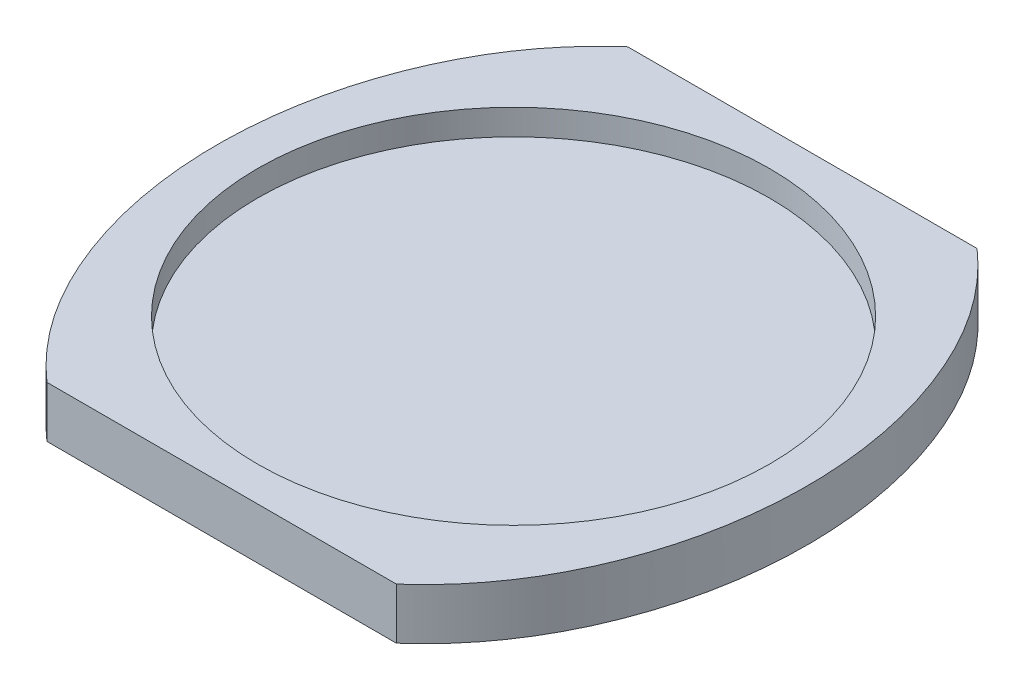
ISO-10303-21;
HEADER;
FILE_DESCRIPTION(('STEP AP214'),'2;1');
FILE_NAME('part.step','',(''),(''),'','','');
FILE_SCHEMA(('AUTOMOTIVE_DESIGN { 1 0 10303 214 1 1 1 1 }'));
ENDSEC;
DATA;
#1=APPLICATION_CONTEXT('core data for automotive mechanical design processes');
#2=APPLICATION_PROTOCOL_DEFINITION('international standard','automotive_design',2000,#1);
#3=PRODUCT_CONTEXT('',#1,'mechanical');
#4=PRODUCT('Part','Part','',(#3));
#5=PRODUCT_RELATED_PRODUCT_CATEGORY('part','',(#4));
#6=PRODUCT_DEFINITION_FORMATION('','',#4);
#7=PRODUCT_DEFINITION_CONTEXT('part definition',#1,'design');
#8=PRODUCT_DEFINITION('design','',#6,#7);
#9=PRODUCT_DEFINITION_SHAPE('','',#8);
#10=(LENGTH_UNIT() NAMED_UNIT(*) SI_UNIT(.MILLI.,.METRE.));
#11=(NAMED_UNIT(*) PLANE_ANGLE_UNIT() SI_UNIT($,.RADIAN.));
#12=(NAMED_UNIT(*) SI_UNIT($,.STERADIAN.) SOLID_ANGLE_UNIT());
#13=UNCERTAINTY_MEASURE_WITH_UNIT(LENGTH_MEASURE(1.E-05),#10,'distance_accuracy_value','');
#14=(GEOMETRIC_REPRESENTATION_CONTEXT(3) GLOBAL_UNCERTAINTY_ASSIGNED_CONTEXT((#13)) GLOBAL_UNIT_ASSIGNED_CONTEXT((#10,
#11,#12)) REPRESENTATION_CONTEXT('',''));
#15=CARTESIAN_POINT('',(0.,0.,0.));
#16=DIRECTION('',(0.,0.,1.));
#17=DIRECTION('',(1.,0.,0.));
#18=AXIS2_PLACEMENT_3D('',#15,#16,#17);
#19=CARTESIAN_POINT('',(-1.20528638708338,10.,140.02554995066));
#20=CARTESIAN_POINT('',(0.920792340002641,10.,140.049990771243));
#21=CARTESIAN_POINT('',(3.04527862196246,10.,140.002892476779));
#22=CARTESIAN_POINT('',(7.29110326082642,10.,139.767278284785));
#23=CARTESIAN_POINT('',(9.39870916827806,10.,139.579437142989));
#24=CARTESIAN_POINT('',(15.6752938362409,10.,138.811953228453));
#25=CARTESIAN_POINT('',(19.7991114751093,10.,138.029795641961));
#26=CARTESIAN_POINT('',(27.9298133105347,10.,135.943281840369));
#27=CARTESIAN_POINT('',(31.9367445606062,10.,134.63913575575));
#28=CARTESIAN_POINT('',(37.8597122345697,10.,132.29247734956));
#29=CARTESIAN_POINT('',(39.804221594686,10.,131.450894745535));
#30=CARTESIAN_POINT('',(43.6235587369388,10.,129.659192275842));
#31=CARTESIAN_POINT('',(45.5004659954884,10.,128.708195238747));
#32=CARTESIAN_POINT('',(51.0358335002431,10.,125.694698111287));
#33=CARTESIAN_POINT('',(54.5995817859504,10.,123.472773180051));
#34=CARTESIAN_POINT('',(59.7646510161631,10.,119.83596783277));
#35=CARTESIAN_POINT('',(61.456150350394,10.,118.572881079917));
#36=CARTESIAN_POINT('',(63.9483979776453,10.,116.602501944214));
#37=CARTESIAN_POINT('',(64.7726430804735,10.,115.93220719582));
#38=CARTESIAN_POINT('',(66.3983298158988,10.,114.572915866655));
#39=CARTESIAN_POINT('',(67.2003712863113,10.,113.883479535508));
#40=CARTESIAN_POINT('',(71.157814339861,10.,110.388473165371));
#41=CARTESIAN_POINT('',(74.1555785096569,10.,107.440023101746));
#42=CARTESIAN_POINT('',(79.8390481747622,10.,101.260277994018));
#43=CARTESIAN_POINT('',(82.5265319209967,10.,98.0305947280539));
#44=CARTESIAN_POINT('',(86.3251977147509,10.,92.9752813309531));
#45=CARTESIAN_POINT('',(87.5520836836411,10.,91.2545233794965));
#46=CARTESIAN_POINT('',(89.9282731303614,10.,87.7426879502787));
#47=CARTESIAN_POINT('',(91.0711612776607,10.,85.9612131190319));
#48=CARTESIAN_POINT('',(93.2642045811713,10.,82.3580059661192));
#49=CARTESIAN_POINT('',(94.3154917157062,10.,80.534886625944));
#50=CARTESIAN_POINT('',(96.3299149319838,10.,76.8467189643629));
#51=CARTESIAN_POINT('',(97.2918873119615,10.,74.9811171290968));
#52=CARTESIAN_POINT('',(100.057054093092,10.,69.3268768069569));
#53=CARTESIAN_POINT('',(101.744965365421,10.,65.4834039875176));
#54=CARTESIAN_POINT('',(104.05020729869,10.,59.6104007612184));
#55=CARTESIAN_POINT('',(104.780795243212,10.,57.6347410951742));
#56=CARTESIAN_POINT('',(106.166809964774,10.,53.6476714109255));
#57=CARTESIAN_POINT('',(106.823248506635,10.,51.6326896378548));
#58=CARTESIAN_POINT('',(108.669969422364,10.,45.566700203736));
#59=CARTESIAN_POINT('',(109.738950442071,10.,41.4940028696998));
#60=CARTESIAN_POINT('',(111.566738835501,10.,33.2937056484887));
#61=CARTESIAN_POINT('',(112.325433149777,10.,29.1660857491303));
#62=CARTESIAN_POINT('',(113.538180224866,10.,20.8569226100719));
#63=CARTESIAN_POINT('',(113.992347502384,10.,16.6753996404997));
#64=CARTESIAN_POINT('',(114.369037649537,10.,11.4146844549471));
#65=CARTESIAN_POINT('',(114.434803630639,10.,10.3608471091848));
#66=CARTESIAN_POINT('',(114.547109074606,10.,8.24976921125306));
#67=CARTESIAN_POINT('',(114.593657534284,10.,7.19184436293376));
#68=CARTESIAN_POINT('',(114.703986475404,10.,4.02388278012006));
#69=CARTESIAN_POINT('',(114.738672000487,10.,1.91662203118648));
#70=CARTESIAN_POINT('',(114.721208012319,10.,-8.59653117699563));
#71=CARTESIAN_POINT('',(114.100106337514,10.,-16.9334234977429));
#72=CARTESIAN_POINT('',(112.263373890425,10.,-29.3289976698746));
#73=CARTESIAN_POINT('',(111.499343946004,10.,-33.4424477808344));
#74=CARTESIAN_POINT('',(110.118494220787,10.,-39.5841468021628));
#75=CARTESIAN_POINT('',(109.36932440906,10.,-42.6478719711002));
#76=CARTESIAN_POINT('',(108.529677635443,10.,-45.7006244725206));
#77=CARTESIAN_POINT('',(107.949499473807,10.,-47.7333171252073));
#78=CARTESIAN_POINT('',(107.648881575584,10.,-48.7494324370532));
#79=CARTESIAN_POINT('',(106.100547872149,10.,-53.8025628642627));
#80=CARTESIAN_POINT('',(104.714467283943,10.,-57.7689447718025));
#81=CARTESIAN_POINT('',(101.648347062474,10.,-65.549912048374));
#82=CARTESIAN_POINT('',(99.9682060403706,10.,-69.3644450615586));
#83=CARTESIAN_POINT('',(97.2226218960979,10.,-74.9698651644848));
#84=CARTESIAN_POINT('',(96.2682519364343,10.,-76.8181089570498));
#85=CARTESIAN_POINT('',(94.272709900023,10.,-80.4697730841829));
#86=CARTESIAN_POINT('',(93.232568115808,10.,-82.2737254481037));
#87=CARTESIAN_POINT('',(89.9823500981182,10.,-87.6185593350731));
#88=CARTESIAN_POINT('',(87.6428591752401,10.,-91.0926128349213));
#89=CARTESIAN_POINT('',(84.4819229399602,10.,-95.3130167771443));
#90=CARTESIAN_POINT('',(83.8376546890325,10.,-96.1508590959783));
#91=CARTESIAN_POINT('',(82.5254510120582,10.,-97.8143223194055));
#92=CARTESIAN_POINT('',(81.8566402591663,10.,-98.6412133803784));
#93=CARTESIAN_POINT('',(79.8221250333447,10.,-101.093717437425));
#94=CARTESIAN_POINT('',(78.4305274467696,10.,-102.688859663543));
#95=CARTESIAN_POINT('',(74.1493118978461,10.,-107.353958125192));
#96=CARTESIAN_POINT('',(71.1536168484906,10.,-110.303977016383));
#97=CARTESIAN_POINT('',(64.8673547647526,10.,-115.870614214326));
#98=CARTESIAN_POINT('',(61.5766563215531,10.,-118.487083942107));
#99=CARTESIAN_POINT('',(56.4047771523009,10.,-122.145142784413));
#100=CARTESIAN_POINT('',(54.6413986926695,10.,-123.319926459521));
#101=CARTESIAN_POINT('',(51.9340899571905,10.,-125.011728378973));
#102=CARTESIAN_POINT('',(51.0236816993843,10.,-125.562366877274));
#103=CARTESIAN_POINT('',(49.1936583706117,10.,-126.632857882623));
#104=CARTESIAN_POINT('',(48.273010775261,10.,-127.153359084485));
#105=CARTESIAN_POINT('',(43.6415389374154,10.,-129.682001779298));
#106=CARTESIAN_POINT('',(39.8461901816601,10.,-131.469016566157));
#107=CARTESIAN_POINT('',(32.0729937056162,10.,-134.5656060064));
#108=CARTESIAN_POINT('',(28.0951005700004,10.,-135.8750618476));
#109=CARTESIAN_POINT('',(21.9832916291392,10.,-137.459987939366));
#110=CARTESIAN_POINT('',(19.9217217975605,10.,-137.924724312141));
#111=CARTESIAN_POINT('',(16.7915185648223,10.,-138.522812496313));
#112=CARTESIAN_POINT('',(15.7401209537149,10.,-138.705899717754));
#113=CARTESIAN_POINT('',(13.6349781238379,10.,-139.036596854802));
#114=CARTESIAN_POINT('',(12.5810205335258,10.,-139.184317528794));
#115=CARTESIAN_POINT('',(7.30428897990074,10.,-139.834619600772));
#116=CARTESIAN_POINT('',(3.06080351756213,10.,-140.073814325473));
#117=CARTESIAN_POINT('',(-1.20528638708341,10.,-140.02554995066));
#118=B_SPLINE_CURVE_WITH_KNOTS('',3,(#19,#20,#21,#22,#23,#24,#25,#26,#27,#28,#29,#30,#31,#32,
#33,#34,#35,#36,#37,#38,#39,#40,#41,#42,#43,#44,#45,#46,#47,#48,#49,#50,#51,#52,#53,#54,#55,#56,
#57,#58,#59,#60,#61,#62,#63,#64,#65,#66,#67,#68,#69,#70,#71,#72,#73,#74,#75,#76,#77,#78,#79,#80,
#81,#82,#83,#84,#85,#86,#87,#88,#89,#90,#91,#92,#93,#94,#95,#96,#97,#98,#99,#100,#101,#102,#103,
#104,#105,#106,#107,#108,#109,#110,#111,#112,#113,#114,#115,#116,#117),.UNSPECIFIED.,.F.,.F.,(4,
2,2,2,2,2,2,2,2,2,2,2,2,2,2,2,2,2,2,2,2,2,2,2,2,2,2,2,1,2,2,2,2,2,2,2,2,2,2,2,2,2,2,2,2,2,2,2,2,
4),(0.,0.015625,0.03125,0.0624999999999999,0.0937499999999999,0.109375,0.125,0.15625,0.171875,
0.1796875,0.1875,0.21875,0.25,0.265625,0.28125,0.296875,0.3125,0.34375,0.359375,0.375,0.40625,
0.4375,0.46875,0.4765625,0.484375,0.5,0.5625,0.59375,0.609375,0.6171875,0.625,0.65625,
0.687500000000001,0.703125000000001,0.71875,0.750000000000001,0.757812500000001,
0.765625000000001,0.781250000000001,0.8125,0.84375,0.859375,0.8671875,0.875,0.90625,0.9375,
0.953125,0.9609375,0.96875,1.),.UNSPECIFIED.);
#119=DIRECTION('',(0.,-1.,0.));
#120=VECTOR('',#119,1.);
#121=SURFACE_OF_LINEAR_EXTRUSION('',#118,#120);
#122=CARTESIAN_POINT('',(67.6776002930337,-10.,113.461025966587));
#123=CARTESIAN_POINT('',(67.7825380753388,-10.,113.369010699456));
#124=CARTESIAN_POINT('',(67.8872910852352,-10.,113.276827957576));
#125=CARTESIAN_POINT('',(71.157814339861,-10.,110.388473165371));
#126=CARTESIAN_POINT('',(74.1555785096569,-10.,107.440023101746));
#127=CARTESIAN_POINT('',(79.8390481747622,-10.,101.260277994018));
#128=CARTESIAN_POINT('',(82.5265319209967,-10.,98.0305947280539));
#129=CARTESIAN_POINT('',(86.3251977147509,-10.,92.9752813309531));
#130=CARTESIAN_POINT('',(87.5520836836411,-10.,91.2545233794965));
#131=CARTESIAN_POINT('',(89.9282731303614,-10.,87.7426879502787));
#132=CARTESIAN_POINT('',(91.0711612776607,-10.,85.9612131190319));
#133=CARTESIAN_POINT('',(93.2642045811713,-10.,82.3580059661192));
#134=CARTESIAN_POINT('',(94.3154917157062,-10.,80.534886625944));
#135=CARTESIAN_POINT('',(96.3299149319838,-10.,76.8467189643629));
#136=CARTESIAN_POINT('',(97.2918873119615,-10.,74.9811171290968));
#137=CARTESIAN_POINT('',(100.057054093092,-10.,69.3268768069569));
#138=CARTESIAN_POINT('',(101.744965365421,-10.,65.4834039875176));
#139=CARTESIAN_POINT('',(104.05020729869,-10.,59.6104007612184));
#140=CARTESIAN_POINT('',(104.780795243212,-10.,57.6347410951742));
#141=CARTESIAN_POINT('',(106.166809964774,-10.,53.6476714109255));
#142=CARTESIAN_POINT('',(106.823248506635,-10.,51.6326896378548));
#143=CARTESIAN_POINT('',(108.669969422364,-10.,45.566700203736));
#144=CARTESIAN_POINT('',(109.738950442071,-10.,41.4940028696998));
#145=CARTESIAN_POINT('',(111.566738835501,-10.,33.2937056484887));
#146=CARTESIAN_POINT('',(112.325433149777,-10.,29.1660857491303));
#147=CARTESIAN_POINT('',(113.538180224866,-10.,20.8569226100719));
#148=CARTESIAN_POINT('',(113.992347502384,-10.,16.6753996404997));
#149=CARTESIAN_POINT('',(114.369037649537,-10.,11.4146844549471));
#150=CARTESIAN_POINT('',(114.434803630639,-10.,10.3608471091848));
#151=CARTESIAN_POINT('',(114.547109074606,-10.,8.24976921125306));
#152=CARTESIAN_POINT('',(114.593657534284,-10.,7.19184436293376));
#153=CARTESIAN_POINT('',(114.703986475404,-10.,4.02388278012006));
#154=CARTESIAN_POINT('',(114.738672000487,-10.,1.91662203118648));
#155=CARTESIAN_POINT('',(114.721208012319,-10.,-8.59653117699563));
#156=CARTESIAN_POINT('',(114.100106337514,-10.,-16.9334234977429));
#157=CARTESIAN_POINT('',(112.263373890425,-10.,-29.3289976698746));
#158=CARTESIAN_POINT('',(111.499343946004,-10.,-33.4424477808344));
#159=CARTESIAN_POINT('',(110.118494220787,-10.,-39.5841468021628));
#160=CARTESIAN_POINT('',(109.36932440906,-10.,-42.6478719711002));
#161=CARTESIAN_POINT('',(108.529677635443,-10.,-45.7006244725206));
#162=CARTESIAN_POINT('',(107.949499473807,-10.,-47.7333171252073));
#163=CARTESIAN_POINT('',(107.648881575584,-10.,-48.7494324370532));
#164=CARTESIAN_POINT('',(106.100547872149,-10.,-53.8025628642627));
#165=CARTESIAN_POINT('',(104.714467283943,-10.,-57.7689447718025));
#166=CARTESIAN_POINT('',(101.648347062474,-10.,-65.549912048374));
#167=CARTESIAN_POINT('',(99.9682060403706,-10.,-69.3644450615586));
#168=CARTESIAN_POINT('',(97.2226218960979,-10.,-74.9698651644848));
#169=CARTESIAN_POINT('',(96.2682519364343,-10.,-76.8181089570498));
#170=CARTESIAN_POINT('',(94.272709900023,-10.,-80.4697730841829));
#171=CARTESIAN_POINT('',(93.232568115808,-10.,-82.2737254481037));
#172=CARTESIAN_POINT('',(89.9823500981182,-10.,-87.6185593350731));
#173=CARTESIAN_POINT('',(87.6428591752401,-10.,-91.0926128349213));
#174=CARTESIAN_POINT('',(84.4819229399602,-10.,-95.3130167771443));
#175=CARTESIAN_POINT('',(83.8376546890325,-10.,-96.1508590959783));
#176=CARTESIAN_POINT('',(82.5254510120582,-10.,-97.8143223194055));
#177=CARTESIAN_POINT('',(81.8566402591663,-10.,-98.6412133803784));
#178=CARTESIAN_POINT('',(79.8221250333447,-10.,-101.093717437425));
#179=CARTESIAN_POINT('',(78.4305274467696,-10.,-102.688859663543));
#180=CARTESIAN_POINT('',(74.1493118978461,-10.,-107.353958125192));
#181=CARTESIAN_POINT('',(71.1536168484906,-10.,-110.303977016383));
#182=CARTESIAN_POINT('',(67.8694237340561,-10.,-113.212209494207));
#183=CARTESIAN_POINT('',(67.7280644360532,-10.,-113.336787311516));
#184=CARTESIAN_POINT('',(67.5864070399778,-10.,-113.461028080625));
#185=B_SPLINE_CURVE_WITH_KNOTS('',3,(#122,#123,#124,#125,#126,#127,#128,#129,#130,#131,#132,
#133,#134,#135,#136,#137,#138,#139,#140,#141,#142,#143,#144,#145,#146,#147,#148,#149,#150,#151,
#152,#153,#154,#155,#156,#157,#158,#159,#160,#161,#162,#163,#164,#165,#166,#167,#168,#169,#170,
#171,#172,#173,#174,#175,#176,#177,#178,#179,#180,#181,#182,#183,#184),.UNSPECIFIED.,.F.,.F.,(4,
2,2,2,2,2,2,2,2,2,2,2,2,2,2,2,2,2,2,1,2,2,2,2,2,2,2,2,2,2,2,4),(0.186467838790068,0.1875,
0.21875,0.25,0.265625,0.28125,0.296875,0.3125,0.34375,0.359375,0.375,0.40625,0.4375,0.46875,
0.4765625,0.484375,0.5,0.5625,0.59375,0.609375,0.6171875,0.625,0.65625,0.687500000000001,
0.703125000000001,0.71875,0.750000000000001,0.757812500000001,0.765625000000001,
0.781250000000001,0.8125,0.813902483609164),.UNSPECIFIED.);
#186=CARTESIAN_POINT('',(67.6775992567552,-10.,113.461024784775));
#187=VERTEX_POINT('',#186);
#188=CARTESIAN_POINT('',(67.5864055946705,-10.,-113.461026432694));
#189=VERTEX_POINT('',#188);
#190=EDGE_CURVE('E96',#187,#189,#185,.T.);
#191=ORIENTED_EDGE('',*,*,#190,.T.);
#192=DIRECTION('',(0.,-1.,0.));
#193=VECTOR('',#192,1.);
#194=CARTESIAN_POINT('',(67.5864107978546,10.,-113.461024784775));
#195=LINE('',#194,#193);
#196=CARTESIAN_POINT('',(67.5864107978546,10.,-113.461024784775));
#197=VERTEX_POINT('',#196);
#198=EDGE_CURVE('E60',#189,#197,#195,.F.);
#199=ORIENTED_EDGE('',*,*,#198,.T.);
#200=CARTESIAN_POINT('',(67.5864157583739,10.,-113.461020434146));
#201=CARTESIAN_POINT('',(67.7280702360863,10.,-113.336782200034));
#202=CARTESIAN_POINT('',(67.869426627975,10.,-113.212206931572));
#203=CARTESIAN_POINT('',(71.1536168484906,10.,-110.303977016383));
#204=CARTESIAN_POINT('',(74.1493118978461,10.,-107.353958125192));
#205=CARTESIAN_POINT('',(78.4305274467696,10.,-102.688859663543));
#206=CARTESIAN_POINT('',(79.8221250333447,10.,-101.093717437425));
#207=CARTESIAN_POINT('',(81.8566402591663,10.,-98.6412133803784));
#208=CARTESIAN_POINT('',(82.5254510120582,10.,-97.8143223194055));
#209=CARTESIAN_POINT('',(83.8376546890325,10.,-96.1508590959783));
#210=CARTESIAN_POINT('',(84.4819229399602,10.,-95.3130167771443));
#211=CARTESIAN_POINT('',(87.6428591752401,10.,-91.0926128349213));
#212=CARTESIAN_POINT('',(89.9823500981182,10.,-87.6185593350731));
#213=CARTESIAN_POINT('',(93.232568115808,10.,-82.2737254481037));
#214=CARTESIAN_POINT('',(94.272709900023,10.,-80.4697730841829));
#215=CARTESIAN_POINT('',(96.2682519364343,10.,-76.8181089570498));
#216=CARTESIAN_POINT('',(97.2226218960979,10.,-74.9698651644848));
#217=CARTESIAN_POINT('',(99.9682060403706,10.,-69.3644450615586));
#218=CARTESIAN_POINT('',(101.648347062474,10.,-65.549912048374));
#219=CARTESIAN_POINT('',(104.714467283943,10.,-57.7689447718025));
#220=CARTESIAN_POINT('',(106.100547872149,10.,-53.8025628642627));
#221=CARTESIAN_POINT('',(107.648881575584,10.,-48.7494324370532));
#222=CARTESIAN_POINT('',(107.949499473807,10.,-47.7333171252073));
#223=CARTESIAN_POINT('',(108.529677635443,10.,-45.7006244725206));
#224=CARTESIAN_POINT('',(109.36932440906,10.,-42.6478719711002));
#225=CARTESIAN_POINT('',(110.118494220787,10.,-39.5841468021628));
#226=CARTESIAN_POINT('',(111.499343946004,10.,-33.4424477808344));
#227=CARTESIAN_POINT('',(112.263373890425,10.,-29.3289976698746));
#228=CARTESIAN_POINT('',(114.100106337514,10.,-16.9334234977429));
#229=CARTESIAN_POINT('',(114.721208012319,10.,-8.59653117699563));
#230=CARTESIAN_POINT('',(114.738672000487,10.,1.91662203118648));
#231=CARTESIAN_POINT('',(114.703986475404,10.,4.02388278012006));
#232=CARTESIAN_POINT('',(114.593657534284,10.,7.19184436293376));
#233=CARTESIAN_POINT('',(114.547109074606,10.,8.24976921125306));
#234=CARTESIAN_POINT('',(114.434803630639,10.,10.3608471091848));
#235=CARTESIAN_POINT('',(114.369037649537,10.,11.4146844549471));
#236=CARTESIAN_POINT('',(113.992347502384,10.,16.6753996404997));
#237=CARTESIAN_POINT('',(113.538180224866,10.,20.8569226100719));
#238=CARTESIAN_POINT('',(112.325433149777,10.,29.1660857491303));
#239=CARTESIAN_POINT('',(111.566738835501,10.,33.2937056484887));
#240=CARTESIAN_POINT('',(109.738950442071,10.,41.4940028696998));
#241=CARTESIAN_POINT('',(108.669969422364,10.,45.566700203736));
#242=CARTESIAN_POINT('',(106.823248506635,10.,51.6326896378548));
#243=CARTESIAN_POINT('',(106.166809964774,10.,53.6476714109255));
#244=CARTESIAN_POINT('',(104.780795243212,10.,57.6347410951742));
#245=CARTESIAN_POINT('',(104.05020729869,10.,59.6104007612184));
#246=CARTESIAN_POINT('',(101.744965365421,10.,65.4834039875176));
#247=CARTESIAN_POINT('',(100.057054093092,10.,69.3268768069569));
#248=CARTESIAN_POINT('',(97.2918873119615,10.,74.9811171290968));
#249=CARTESIAN_POINT('',(96.3299149319838,10.,76.8467189643629));
#250=CARTESIAN_POINT('',(94.3154917157062,10.,80.534886625944));
#251=CARTESIAN_POINT('',(93.2642045811713,10.,82.3580059661192));
#252=CARTESIAN_POINT('',(91.0711612776607,10.,85.9612131190319));
#253=CARTESIAN_POINT('',(89.9282731303614,10.,87.7426879502787));
#254=CARTESIAN_POINT('',(87.5520836836411,10.,91.2545233794965));
#255=CARTESIAN_POINT('',(86.3251977147509,10.,92.9752813309531));
#256=CARTESIAN_POINT('',(82.5265319209967,10.,98.0305947280539));
#257=CARTESIAN_POINT('',(79.8390481747622,10.,101.260277994018));
#258=CARTESIAN_POINT('',(74.1555785096569,10.,107.440023101746));
#259=CARTESIAN_POINT('',(71.157814339861,10.,110.388473165371));
#260=CARTESIAN_POINT('',(67.8872898795455,10.,113.276829022378));
#261=CARTESIAN_POINT('',(67.7825356597116,10.,113.36901282521));
#262=CARTESIAN_POINT('',(67.6775966632015,10.,113.461029149425));
#263=B_SPLINE_CURVE_WITH_KNOTS('',3,(#200,#201,#202,#203,#204,#205,#206,#207,#208,#209,#210,
#211,#212,#213,#214,#215,#216,#217,#218,#219,#220,#221,#222,#223,#224,#225,#226,#227,#228,#229,
#230,#231,#232,#233,#234,#235,#236,#237,#238,#239,#240,#241,#242,#243,#244,#245,#246,#247,#248,
#249,#250,#251,#252,#253,#254,#255,#256,#257,#258,#259,#260,#261,#262),.UNSPECIFIED.,.F.,.F.,(4,
2,2,2,2,2,2,2,2,2,2,2,1,2,2,2,2,2,2,2,2,2,2,2,2,2,2,2,2,2,2,4),(0.186467826889137,
0.187870281726045,0.219120281726045,0.234745281726045,0.242557781726045,0.250370281726045,
0.281620281726045,0.297245281726045,0.312870281726045,0.344120281726045,0.375370281726045,
0.383182781726045,0.390995281726045,0.406620281726045,0.437870281726045,0.500370281726045,
0.515995281726045,0.523807781726045,0.531620281726045,0.562870281726045,0.594120281726045,
0.625370281726045,0.640995281726045,0.656620281726045,0.687870281726046,0.703495281726046,
0.719120281726046,0.734745281726046,0.750370281726046,0.781620281726046,0.812870281726046,
0.813902454836909),.UNSPECIFIED.);
#264=CARTESIAN_POINT('',(67.677601640818,10.,113.461024784775));
#265=VERTEX_POINT('',#264);
#266=EDGE_CURVE('E99',#265,#197,#263,.F.);
#267=ORIENTED_EDGE('',*,*,#266,.F.);
#268=DIRECTION('',(0.,-1.,0.));
#269=VECTOR('',#268,1.);
#270=CARTESIAN_POINT('',(67.677601640818,10.,113.461024784775));
#271=LINE('',#270,#269);
#272=EDGE_CURVE('E84',#265,#187,#271,.T.);
#273=ORIENTED_EDGE('',*,*,#272,.T.);
#274=EDGE_LOOP('',(#191,#199,#267,#273));
#275=FACE_BOUND('',#274,.T.);
#276=ADVANCED_FACE('F41',(#275),#121,.F.);
#277=CARTESIAN_POINT('',(0.,10.,0.));
#278=DIRECTION('',(0.,-1.,0.));
#279=DIRECTION('',(0.,0.,-1.));
#280=AXIS2_PLACEMENT_3D('',#277,#278,#279);
#281=CYLINDRICAL_SURFACE('',#280,100.);
#282=CARTESIAN_POINT('',(0.,0.,0.));
#283=DIRECTION('',(0.,1.,0.));
#284=DIRECTION('',(0.,0.,1.));
#285=AXIS2_PLACEMENT_3D('',#282,#283,#284);
#286=CIRCLE('',#285,100.);
#287=CARTESIAN_POINT('',(0.,0.,100.));
#288=VERTEX_POINT('',#287);
#289=EDGE_CURVE('E91',#288,#288,#286,.T.);
#290=ORIENTED_EDGE('',*,*,#289,.F.);
#291=EDGE_LOOP('',(#290));
#292=FACE_BOUND('',#291,.T.);
#293=CARTESIAN_POINT('',(0.,10.,0.));
#294=DIRECTION('',(0.,1.,0.));
#295=DIRECTION('',(0.,0.,1.));
#296=AXIS2_PLACEMENT_3D('',#293,#294,#295);
#297=CIRCLE('',#296,100.);
#298=CARTESIAN_POINT('',(0.,10.,100.));
#299=VERTEX_POINT('',#298);
#300=EDGE_CURVE('E157',#299,#299,#297,.T.);
#301=ORIENTED_EDGE('',*,*,#300,.T.);
#302=EDGE_LOOP('',(#301));
#303=FACE_BOUND('',#302,.T.);
#304=ADVANCED_FACE('F43',(#292,#303),#281,.F.);
#305=CARTESIAN_POINT('',(0.,10.,-140.02554995066));
#306=CARTESIAN_POINT('',(-2.12607872708449,10.,-140.049990771238));
#307=CARTESIAN_POINT('',(-4.25056500904399,10.,-140.002892476774));
#308=CARTESIAN_POINT('',(-8.49638964790809,10.,-139.76727828478));
#309=CARTESIAN_POINT('',(-10.6039955553594,10.,-139.579437142984));
#310=CARTESIAN_POINT('',(-16.8805802233224,10.,-138.811953228448));
#311=CARTESIAN_POINT('',(-21.0043978621905,10.,-138.029795641955));
#312=CARTESIAN_POINT('',(-29.1350996976166,10.,-135.943281840364));
#313=CARTESIAN_POINT('',(-33.1420309476874,10.,-134.639135755744));
#314=CARTESIAN_POINT('',(-39.0649986216507,10.,-132.292477349555));
#315=CARTESIAN_POINT('',(-41.0095079817671,10.,-131.450894745531));
#316=CARTESIAN_POINT('',(-44.8288451240191,10.,-129.659192275837));
#317=CARTESIAN_POINT('',(-46.7057523825689,10.,-128.708195238742));
#318=CARTESIAN_POINT('',(-52.2411198873241,10.,-125.694698111282));
#319=CARTESIAN_POINT('',(-55.8048681730309,10.,-123.472773180045));
#320=CARTESIAN_POINT('',(-60.9699374032429,10.,-119.835967832764));
#321=CARTESIAN_POINT('',(-62.6614367374744,10.,-118.572881079912));
#322=CARTESIAN_POINT('',(-65.1536843647255,10.,-116.602501944209));
#323=CARTESIAN_POINT('',(-65.9779294675539,10.,-115.932207195815));
#324=CARTESIAN_POINT('',(-67.6036162029785,10.,-114.57291586665));
#325=CARTESIAN_POINT('',(-68.4056576733916,10.,-113.883479535503));
#326=CARTESIAN_POINT('',(-72.3631007269418,10.,-110.388473165366));
#327=CARTESIAN_POINT('',(-75.360864896737,10.,-107.44002310174));
#328=CARTESIAN_POINT('',(-81.0443345618416,10.,-101.260277994014));
#329=CARTESIAN_POINT('',(-83.7318183080772,10.,-98.0305947280492));
#330=CARTESIAN_POINT('',(-87.5304841018303,10.,-92.9752813309478));
#331=CARTESIAN_POINT('',(-88.757370070721,10.,-91.2545233794914));
#332=CARTESIAN_POINT('',(-91.1335595174412,10.,-87.7426879502738));
#333=CARTESIAN_POINT('',(-92.2764476647408,10.,-85.961213119027));
#334=CARTESIAN_POINT('',(-94.4694909682504,10.,-82.3580059661149));
#335=CARTESIAN_POINT('',(-95.5207781027861,10.,-80.5348866259399));
#336=CARTESIAN_POINT('',(-97.5352013190621,10.,-76.8467189643583));
#337=CARTESIAN_POINT('',(-98.497173699041,10.,-74.9811171290932));
#338=CARTESIAN_POINT('',(-101.262340480172,10.,-69.3268768069524));
#339=CARTESIAN_POINT('',(-102.950251752501,10.,-65.483403987513));
#340=CARTESIAN_POINT('',(-105.255493685769,10.,-59.6104007612142));
#341=CARTESIAN_POINT('',(-105.986081630293,10.,-57.6347410951705));
#342=CARTESIAN_POINT('',(-107.372096351854,10.,-53.647671410921));
#343=CARTESIAN_POINT('',(-108.028534893715,10.,-51.6326896378511));
#344=CARTESIAN_POINT('',(-109.875255809443,10.,-45.5667002037323));
#345=CARTESIAN_POINT('',(-110.94423682915,10.,-41.494002869696));
#346=CARTESIAN_POINT('',(-112.77202522258,10.,-33.2937056484853));
#347=CARTESIAN_POINT('',(-113.530719536856,10.,-29.1660857491265));
#348=CARTESIAN_POINT('',(-114.743466611946,10.,-20.856922610068));
#349=CARTESIAN_POINT('',(-115.197633889463,10.,-16.6753996404958));
#350=CARTESIAN_POINT('',(-115.574324036616,10.,-11.4146844549438));
#351=CARTESIAN_POINT('',(-115.640090017718,10.,-10.3608471091813));
#352=CARTESIAN_POINT('',(-115.752395461686,10.,-8.24976921125003));
#353=CARTESIAN_POINT('',(-115.798943921364,10.,-7.19184436293013));
#354=CARTESIAN_POINT('',(-115.909272862484,10.,-4.0238827801169));
#355=CARTESIAN_POINT('',(-115.943958387567,10.,-1.91662203118305));
#356=CARTESIAN_POINT('',(-115.926494399398,10.,8.59653117699843));
#357=CARTESIAN_POINT('',(-115.305392724593,10.,16.9334234977457));
#358=CARTESIAN_POINT('',(-113.468660277504,10.,29.3289976698773));
#359=CARTESIAN_POINT('',(-112.704630333083,10.,33.4424477808364));
#360=CARTESIAN_POINT('',(-111.323780607867,10.,39.5841468021651));
#361=CARTESIAN_POINT('',(-110.57461079614,10.,42.6478719711022));
#362=CARTESIAN_POINT('',(-109.734964022523,10.,45.7006244725225));
#363=CARTESIAN_POINT('',(-109.154785860887,10.,47.7333171252097));
#364=CARTESIAN_POINT('',(-108.854167962663,10.,48.7494324370557));
#365=CARTESIAN_POINT('',(-107.305834259228,10.,53.8025628642648));
#366=CARTESIAN_POINT('',(-105.919753671023,10.,57.768944771804));
#367=CARTESIAN_POINT('',(-102.853633449555,10.,65.549912048376));
#368=CARTESIAN_POINT('',(-101.17349242745,10.,69.3644450615601));
#369=CARTESIAN_POINT('',(-98.4279082831782,10.,74.969865164487));
#370=CARTESIAN_POINT('',(-97.4735383235149,10.,76.8181089570515));
#371=CARTESIAN_POINT('',(-95.4779962871031,10.,80.4697730841843));
#372=CARTESIAN_POINT('',(-94.437854502888,10.,82.2737254481051));
#373=CARTESIAN_POINT('',(-91.1876364851982,10.,87.6185593350751));
#374=CARTESIAN_POINT('',(-88.8481455623197,10.,91.0926128349225));
#375=CARTESIAN_POINT('',(-85.6872093270402,10.,95.3130167771454));
#376=CARTESIAN_POINT('',(-85.0429410761124,10.,96.1508590959793));
#377=CARTESIAN_POINT('',(-83.7307373991378,10.,97.8143223194065));
#378=CARTESIAN_POINT('',(-83.0619266462461,10.,98.6412133803795));
#379=CARTESIAN_POINT('',(-81.0274114204262,10.,101.093717437426));
#380=CARTESIAN_POINT('',(-79.6358138338502,10.,102.688859663545));
#381=CARTESIAN_POINT('',(-75.354598284926,10.,107.353958125193));
#382=CARTESIAN_POINT('',(-72.3589032355705,10.,110.303977016384));
#383=CARTESIAN_POINT('',(-66.0726411518333,10.,115.870614214327));
#384=CARTESIAN_POINT('',(-62.7819427086339,10.,118.487083942107));
#385=CARTESIAN_POINT('',(-57.6100635393813,10.,122.145142784414));
#386=CARTESIAN_POINT('',(-55.8466850797498,10.,123.319926459521));
#387=CARTESIAN_POINT('',(-53.139376344271,10.,125.011728378973));
#388=CARTESIAN_POINT('',(-52.2289680864647,10.,125.562366877274));
#389=CARTESIAN_POINT('',(-50.3989447576918,10.,126.632857882624));
#390=CARTESIAN_POINT('',(-49.4782971623426,10.,127.153359084485));
#391=CARTESIAN_POINT('',(-44.8468253244965,10.,129.682001779298));
#392=CARTESIAN_POINT('',(-41.0514765687407,10.,131.469016566156));
#393=CARTESIAN_POINT('',(-33.2782800926979,10.,134.5656060064));
#394=CARTESIAN_POINT('',(-29.300386957082,10.,135.8750618476));
#395=CARTESIAN_POINT('',(-23.1885780162205,10.,137.459987939366));
#396=CARTESIAN_POINT('',(-21.1270081846417,10.,137.92472431214));
#397=CARTESIAN_POINT('',(-17.9968049519036,10.,138.522812496313));
#398=CARTESIAN_POINT('',(-16.9454073407963,10.,138.705899717754));
#399=CARTESIAN_POINT('',(-14.8402645109193,10.,139.036596854801));
#400=CARTESIAN_POINT('',(-13.7863069206067,10.,139.184317528794));
#401=CARTESIAN_POINT('',(-8.50957536698215,10.,139.834619600771));
#402=CARTESIAN_POINT('',(-4.26608990464325,10.,140.073814325473));
#403=CARTESIAN_POINT('',(0.,10.,140.025549950659));
#404=B_SPLINE_CURVE_WITH_KNOTS('',3,(#305,#306,#307,#308,#309,#310,#311,#312,#313,#314,#315,
#316,#317,#318,#319,#320,#321,#322,#323,#324,#325,#326,#327,#328,#329,#330,#331,#332,#333,#334,
#335,#336,#337,#338,#339,#340,#341,#342,#343,#344,#345,#346,#347,#348,#349,#350,#351,#352,#353,
#354,#355,#356,#357,#358,#359,#360,#361,#362,#363,#364,#365,#366,#367,#368,#369,#370,#371,#372,
#373,#374,#375,#376,#377,#378,#379,#380,#381,#382,#383,#384,#385,#386,#387,#388,#389,#390,#391,
#392,#393,#394,#395,#396,#397,#398,#399,#400,#401,#402,#403),.UNSPECIFIED.,.F.,.F.,(4,2,2,2,2,2,
2,2,2,2,2,2,2,2,2,2,2,2,2,2,2,2,2,2,2,2,2,2,1,2,2,2,2,2,2,2,2,2,2,2,2,2,2,2,2,2,2,2,2,4),(0.,
0.015625,0.03125,0.0624999999999999,0.0937499999999999,0.109375,0.125,0.15625,0.171875,
0.1796875,0.1875,0.21875,0.25,0.265625,0.28125,0.296875,0.3125,0.34375,0.359375,0.375,0.40625,
0.4375,0.46875,0.4765625,0.484375,0.5,0.5625,0.59375,0.609375,0.6171875,0.625,0.65625,
0.687500000000001,0.703125000000001,0.71875,0.750000000000001,0.757812500000001,
0.765625000000001,0.781250000000001,0.8125,0.84375,0.859375,0.8671875,0.875,0.90625,0.9375,
0.953125,0.9609375,0.96875,1.),.UNSPECIFIED.);
#405=DIRECTION('',(0.,-1.,0.));
#406=VECTOR('',#405,1.);
#407=SURFACE_OF_LINEAR_EXTRUSION('',#404,#406);
#408=CARTESIAN_POINT('',(-68.7916985085133,10.,113.46102362393));
#409=CARTESIAN_POINT('',(-68.9333542036415,10.,113.336784332326));
#410=CARTESIAN_POINT('',(-69.0747118078365,10.,113.212208000594));
#411=CARTESIAN_POINT('',(-72.3589032355705,10.,110.303977016384));
#412=CARTESIAN_POINT('',(-75.354598284926,10.,107.353958125193));
#413=CARTESIAN_POINT('',(-79.6358138338502,10.,102.688859663545));
#414=CARTESIAN_POINT('',(-81.0274114204262,10.,101.093717437426));
#415=CARTESIAN_POINT('',(-83.0619266462461,10.,98.6412133803795));
#416=CARTESIAN_POINT('',(-83.7307373991378,10.,97.8143223194065));
#417=CARTESIAN_POINT('',(-85.0429410761124,10.,96.1508590959793));
#418=CARTESIAN_POINT('',(-85.6872093270402,10.,95.3130167771454));
#419=CARTESIAN_POINT('',(-88.8481455623197,10.,91.0926128349225));
#420=CARTESIAN_POINT('',(-91.1876364851982,10.,87.6185593350751));
#421=CARTESIAN_POINT('',(-94.437854502888,10.,82.2737254481051));
#422=CARTESIAN_POINT('',(-95.4779962871031,10.,80.4697730841843));
#423=CARTESIAN_POINT('',(-97.4735383235149,10.,76.8181089570515));
#424=CARTESIAN_POINT('',(-98.4279082831782,10.,74.969865164487));
#425=CARTESIAN_POINT('',(-101.17349242745,10.,69.3644450615601));
#426=CARTESIAN_POINT('',(-102.853633449555,10.,65.549912048376));
#427=CARTESIAN_POINT('',(-105.919753671023,10.,57.768944771804));
#428=CARTESIAN_POINT('',(-107.305834259228,10.,53.8025628642648));
#429=CARTESIAN_POINT('',(-108.854167962663,10.,48.7494324370557));
#430=CARTESIAN_POINT('',(-109.154785860887,10.,47.7333171252097));
#431=CARTESIAN_POINT('',(-109.734964022523,10.,45.7006244725225));
#432=CARTESIAN_POINT('',(-110.57461079614,10.,42.6478719711022));
#433=CARTESIAN_POINT('',(-111.323780607867,10.,39.5841468021651));
#434=CARTESIAN_POINT('',(-112.704630333083,10.,33.4424477808364));
#435=CARTESIAN_POINT('',(-113.468660277504,10.,29.3289976698773));
#436=CARTESIAN_POINT('',(-115.305392724593,10.,16.9334234977457));
#437=CARTESIAN_POINT('',(-115.926494399398,10.,8.59653117699843));
#438=CARTESIAN_POINT('',(-115.943958387567,10.,-1.91662203118305));
#439=CARTESIAN_POINT('',(-115.909272862484,10.,-4.0238827801169));
#440=CARTESIAN_POINT('',(-115.798943921364,10.,-7.19184436293013));
#441=CARTESIAN_POINT('',(-115.752395461686,10.,-8.24976921125003));
#442=CARTESIAN_POINT('',(-115.640090017718,10.,-10.3608471091813));
#443=CARTESIAN_POINT('',(-115.574324036616,10.,-11.4146844549438));
#444=CARTESIAN_POINT('',(-115.197633889463,10.,-16.6753996404958));
#445=CARTESIAN_POINT('',(-114.743466611946,10.,-20.856922610068));
#446=CARTESIAN_POINT('',(-113.530719536856,10.,-29.1660857491265));
#447=CARTESIAN_POINT('',(-112.77202522258,10.,-33.2937056484853));
#448=CARTESIAN_POINT('',(-110.94423682915,10.,-41.494002869696));
#449=CARTESIAN_POINT('',(-109.875255809443,10.,-45.5667002037323));
#450=CARTESIAN_POINT('',(-108.028534893715,10.,-51.6326896378511));
#451=CARTESIAN_POINT('',(-107.372096351854,10.,-53.647671410921));
#452=CARTESIAN_POINT('',(-105.986081630293,10.,-57.6347410951705));
#453=CARTESIAN_POINT('',(-105.255493685769,10.,-59.6104007612142));
#454=CARTESIAN_POINT('',(-102.950251752501,10.,-65.483403987513));
#455=CARTESIAN_POINT('',(-101.262340480172,10.,-69.3268768069524));
#456=CARTESIAN_POINT('',(-98.497173699041,10.,-74.9811171290932));
#457=CARTESIAN_POINT('',(-97.5352013190621,10.,-76.8467189643583));
#458=CARTESIAN_POINT('',(-95.5207781027861,10.,-80.5348866259399));
#459=CARTESIAN_POINT('',(-94.4694909682504,10.,-82.3580059661149));
#460=CARTESIAN_POINT('',(-92.2764476647408,10.,-85.961213119027));
#461=CARTESIAN_POINT('',(-91.1335595174412,10.,-87.7426879502738));
#462=CARTESIAN_POINT('',(-88.757370070721,10.,-91.2545233794914));
#463=CARTESIAN_POINT('',(-87.5304841018303,10.,-92.9752813309478));
#464=CARTESIAN_POINT('',(-83.7318183080772,10.,-98.0305947280492));
#465=CARTESIAN_POINT('',(-81.0443345618416,10.,-101.260277994014));
#466=CARTESIAN_POINT('',(-75.360864896737,10.,-107.44002310174));
#467=CARTESIAN_POINT('',(-72.3631007269418,10.,-110.388473165366));
#468=CARTESIAN_POINT('',(-69.0925778303359,10.,-113.276827641386));
#469=CARTESIAN_POINT('',(-68.9878251797209,10.,-113.369010068225));
#470=CARTESIAN_POINT('',(-68.8828877579645,10.,-113.461025021463));
#471=B_SPLINE_CURVE_WITH_KNOTS('',3,(#408,#409,#410,#411,#412,#413,#414,#415,#416,#417,#418,
#419,#420,#421,#422,#423,#424,#425,#426,#427,#428,#429,#430,#431,#432,#433,#434,#435,#436,#437,
#438,#439,#440,#441,#442,#443,#444,#445,#446,#447,#448,#449,#450,#451,#452,#453,#454,#455,#456,
#457,#458,#459,#460,#461,#462,#463,#464,#465,#466,#467,#468,#469,#470),.UNSPECIFIED.,.F.,.F.,(4,
2,2,2,2,2,2,2,2,2,2,2,1,2,2,2,2,2,2,2,2,2,2,2,2,2,2,2,2,2,2,4),(0.186467842323957,
0.187870309163416,0.219120309163416,0.234745309163416,0.242557809163416,0.250370309163416,
0.281620309163416,0.297245309163416,0.312870309163416,0.344120309163416,0.375370309163416,
0.383182809163416,0.390995309163416,0.406620309163416,0.437870309163416,0.500370309163416,
0.515995309163416,0.523807809163416,0.531620309163416,0.562870309163416,0.594120309163416,
0.625370309163416,0.640995309163416,0.656620309163416,0.687870309163416,0.703495309163416,
0.719120309163416,0.734745309163416,0.750370309163416,0.781620309163417,0.812870309163417,
0.81390246683946),.UNSPECIFIED.);
#472=CARTESIAN_POINT('',(-68.882888027893,10.,-113.461024784775));
#473=VERTEX_POINT('',#472);
#474=CARTESIAN_POINT('',(-68.791697184936,10.,113.461024784775));
#475=VERTEX_POINT('',#474);
#476=EDGE_CURVE('E164',#473,#475,#471,.F.);
#477=ORIENTED_EDGE('',*,*,#476,.F.);
#478=DIRECTION('',(0.,-1.,0.));
#479=VECTOR('',#478,1.);
#480=CARTESIAN_POINT('',(-68.882888027893,10.,-113.461024784775));
#481=LINE('',#480,#479);
#482=CARTESIAN_POINT('',(-68.882892829875,-10.,-113.461024784775));
#483=VERTEX_POINT('',#482);
#484=EDGE_CURVE('E155',#473,#483,#481,.T.);
#485=ORIENTED_EDGE('',*,*,#484,.T.);
#486=CARTESIAN_POINT('',(-68.8828907426017,-10.,-113.461022404368));
#487=CARTESIAN_POINT('',(-68.9878271659756,-10.,-113.369008320319));
#488=CARTESIAN_POINT('',(-69.0925788217169,-10.,-113.27682676585));
#489=CARTESIAN_POINT('',(-72.3631007269418,-10.,-110.388473165366));
#490=CARTESIAN_POINT('',(-75.360864896737,-10.,-107.44002310174));
#491=CARTESIAN_POINT('',(-81.0443345618416,-10.,-101.260277994014));
#492=CARTESIAN_POINT('',(-83.7318183080772,-10.,-98.0305947280492));
#493=CARTESIAN_POINT('',(-87.5304841018303,-10.,-92.9752813309478));
#494=CARTESIAN_POINT('',(-88.757370070721,-10.,-91.2545233794914));
#495=CARTESIAN_POINT('',(-91.1335595174412,-10.,-87.7426879502738));
#496=CARTESIAN_POINT('',(-92.2764476647408,-10.,-85.961213119027));
#497=CARTESIAN_POINT('',(-94.4694909682504,-10.,-82.3580059661149));
#498=CARTESIAN_POINT('',(-95.5207781027861,-10.,-80.5348866259399));
#499=CARTESIAN_POINT('',(-97.5352013190621,-10.,-76.8467189643583));
#500=CARTESIAN_POINT('',(-98.497173699041,-10.,-74.9811171290932));
#501=CARTESIAN_POINT('',(-101.262340480172,-10.,-69.3268768069524));
#502=CARTESIAN_POINT('',(-102.950251752501,-10.,-65.483403987513));
#503=CARTESIAN_POINT('',(-105.255493685769,-10.,-59.6104007612142));
#504=CARTESIAN_POINT('',(-105.986081630293,-10.,-57.6347410951705));
#505=CARTESIAN_POINT('',(-107.372096351854,-10.,-53.647671410921));
#506=CARTESIAN_POINT('',(-108.028534893715,-10.,-51.6326896378511));
#507=CARTESIAN_POINT('',(-109.875255809443,-10.,-45.5667002037323));
#508=CARTESIAN_POINT('',(-110.94423682915,-10.,-41.494002869696));
#509=CARTESIAN_POINT('',(-112.77202522258,-10.,-33.2937056484853));
#510=CARTESIAN_POINT('',(-113.530719536856,-10.,-29.1660857491265));
#511=CARTESIAN_POINT('',(-114.743466611946,-10.,-20.856922610068));
#512=CARTESIAN_POINT('',(-115.197633889463,-10.,-16.6753996404958));
#513=CARTESIAN_POINT('',(-115.574324036616,-10.,-11.4146844549438));
#514=CARTESIAN_POINT('',(-115.640090017718,-10.,-10.3608471091813));
#515=CARTESIAN_POINT('',(-115.752395461686,-10.,-8.24976921125003));
#516=CARTESIAN_POINT('',(-115.798943921364,-10.,-7.19184436293013));
#517=CARTESIAN_POINT('',(-115.909272862484,-10.,-4.0238827801169));
#518=CARTESIAN_POINT('',(-115.943958387567,-10.,-1.91662203118305));
#519=CARTESIAN_POINT('',(-115.926494399398,-10.,8.59653117699843));
#520=CARTESIAN_POINT('',(-115.305392724593,-10.,16.9334234977457));
#521=CARTESIAN_POINT('',(-113.468660277504,-10.,29.3289976698773));
#522=CARTESIAN_POINT('',(-112.704630333083,-10.,33.4424477808364));
#523=CARTESIAN_POINT('',(-111.323780607867,-10.,39.5841468021651));
#524=CARTESIAN_POINT('',(-110.57461079614,-10.,42.6478719711022));
#525=CARTESIAN_POINT('',(-109.734964022523,-10.,45.7006244725225));
#526=CARTESIAN_POINT('',(-109.154785860887,-10.,47.7333171252097));
#527=CARTESIAN_POINT('',(-108.854167962663,-10.,48.7494324370557));
#528=CARTESIAN_POINT('',(-107.305834259228,-10.,53.8025628642648));
#529=CARTESIAN_POINT('',(-105.919753671023,-10.,57.768944771804));
#530=CARTESIAN_POINT('',(-102.853633449555,-10.,65.549912048376));
#531=CARTESIAN_POINT('',(-101.17349242745,-10.,69.3644450615601));
#532=CARTESIAN_POINT('',(-98.4279082831782,-10.,74.969865164487));
#533=CARTESIAN_POINT('',(-97.4735383235149,-10.,76.8181089570515));
#534=CARTESIAN_POINT('',(-95.4779962871031,-10.,80.4697730841843));
#535=CARTESIAN_POINT('',(-94.437854502888,-10.,82.2737254481051));
#536=CARTESIAN_POINT('',(-91.1876364851982,-10.,87.6185593350751));
#537=CARTESIAN_POINT('',(-88.8481455623197,-10.,91.0926128349225));
#538=CARTESIAN_POINT('',(-85.6872093270402,-10.,95.3130167771454));
#539=CARTESIAN_POINT('',(-85.0429410761124,-10.,96.1508590959793));
#540=CARTESIAN_POINT('',(-83.7307373991378,-10.,97.8143223194065));
#541=CARTESIAN_POINT('',(-83.0619266462461,-10.,98.6412133803795));
#542=CARTESIAN_POINT('',(-81.0274114204262,-10.,101.093717437426));
#543=CARTESIAN_POINT('',(-79.6358138338502,-10.,102.688859663545));
#544=CARTESIAN_POINT('',(-75.354598284926,-10.,107.353958125193));
#545=CARTESIAN_POINT('',(-72.3589032355705,-10.,110.303977016384));
#546=CARTESIAN_POINT('',(-69.0747105318275,-10.,113.212209130531));
#547=CARTESIAN_POINT('',(-68.9333516462464,-10.,113.336786586119));
#548=CARTESIAN_POINT('',(-68.7916946643312,-10.,113.461026995474));
#549=B_SPLINE_CURVE_WITH_KNOTS('',3,(#486,#487,#488,#489,#490,#491,#492,#493,#494,#495,#496,
#497,#498,#499,#500,#501,#502,#503,#504,#505,#506,#507,#508,#509,#510,#511,#512,#513,#514,#515,
#516,#517,#518,#519,#520,#521,#522,#523,#524,#525,#526,#527,#528,#529,#530,#531,#532,#533,#534,
#535,#536,#537,#538,#539,#540,#541,#542,#543,#544,#545,#546,#547,#548),.UNSPECIFIED.,.F.,.F.,(4,
2,2,2,2,2,2,2,2,2,2,2,2,2,2,2,2,2,2,1,2,2,2,2,2,2,2,2,2,2,2,4),(0.186467852109523,0.1875,
0.21875,0.25,0.265625,0.28125,0.296875,0.3125,0.34375,0.359375,0.375,0.40625,0.4375,0.46875,
0.4765625,0.484375,0.5,0.5625,0.59375,0.609375,0.6171875,0.625,0.65625,0.687500000000001,
0.703125000000001,0.71875,0.750000000000001,0.757812500000001,0.765625000000001,
0.781250000000001,0.8125,0.813902479525943),.UNSPECIFIED.);
#550=CARTESIAN_POINT('',(-68.7916936948895,-10.,113.461025890119));
#551=VERTEX_POINT('',#550);
#552=EDGE_CURVE('E107',#483,#551,#549,.T.);
#553=ORIENTED_EDGE('',*,*,#552,.T.);
#554=DIRECTION('',(0.,-1.,0.));
#555=VECTOR('',#554,1.);
#556=CARTESIAN_POINT('',(-68.791697184936,10.,113.461024784775));
#557=LINE('',#556,#555);
#558=EDGE_CURVE('E67',#551,#475,#557,.F.);
#559=ORIENTED_EDGE('',*,*,#558,.T.);
#560=EDGE_LOOP('',(#477,#485,#553,#559));
#561=FACE_BOUND('',#560,.T.);
#562=ADVANCED_FACE('F134',(#561),#407,.F.);
#563=CARTESIAN_POINT('',(0.,10.,0.));
#564=DIRECTION('',(0.,1.,0.));
#565=DIRECTION('',(0.,0.,1.));
#566=AXIS2_PLACEMENT_3D('',#563,#564,#565);
#567=PLANE('',#566);
#568=DIRECTION('',(1.,0.,0.));
#569=VECTOR('',#568,1.);
#570=CARTESIAN_POINT('',(0.,10.,-113.461024784775));
#571=LINE('',#570,#569);
#572=EDGE_CURVE('E108',#473,#197,#571,.T.);
#573=ORIENTED_EDGE('',*,*,#572,.F.);
#574=ORIENTED_EDGE('',*,*,#476,.T.);
#575=DIRECTION('',(-1.,0.,0.));
#576=VECTOR('',#575,1.);
#577=CARTESIAN_POINT('',(0.,10.,113.461024784775));
#578=LINE('',#577,#576);
#579=EDGE_CURVE('E102',#265,#475,#578,.T.);
#580=ORIENTED_EDGE('',*,*,#579,.F.);
#581=ORIENTED_EDGE('',*,*,#266,.T.);
#582=EDGE_LOOP('',(#573,#574,#580,#581));
#583=FACE_BOUND('',#582,.T.);
#584=ORIENTED_EDGE('',*,*,#300,.F.);
#585=EDGE_LOOP('',(#584));
#586=FACE_BOUND('',#585,.T.);
#587=ADVANCED_FACE('F131',(#583,#586),#567,.T.);
#588=CARTESIAN_POINT('',(0.,-10.,0.));
#589=DIRECTION('',(0.,1.,0.));
#590=DIRECTION('',(0.,0.,1.));
#591=AXIS2_PLACEMENT_3D('',#588,#589,#590);
#592=PLANE('',#591);
#593=ORIENTED_EDGE('',*,*,#552,.F.);
#594=DIRECTION('',(1.,0.,0.));
#595=VECTOR('',#594,1.);
#596=CARTESIAN_POINT('',(0.,-10.,-113.461024784775));
#597=LINE('',#596,#595);
#598=EDGE_CURVE('E11',#483,#189,#597,.T.);
#599=ORIENTED_EDGE('',*,*,#598,.T.);
#600=ORIENTED_EDGE('',*,*,#190,.F.);
#601=DIRECTION('',(-1.,0.,0.));
#602=VECTOR('',#601,1.);
#603=CARTESIAN_POINT('',(0.,-10.,113.461024784775));
#604=LINE('',#603,#602);
#605=EDGE_CURVE('E52',#187,#551,#604,.T.);
#606=ORIENTED_EDGE('',*,*,#605,.T.);
#607=EDGE_LOOP('',(#593,#599,#600,#606));
#608=FACE_BOUND('',#607,.T.);
#609=ADVANCED_FACE('F105',(#608),#592,.F.);
#610=CARTESIAN_POINT('',(0.,0.,0.));
#611=DIRECTION('',(0.,1.,0.));
#612=DIRECTION('',(0.,0.,1.));
#613=AXIS2_PLACEMENT_3D('',#610,#611,#612);
#614=PLANE('',#613);
#615=ORIENTED_EDGE('',*,*,#289,.T.);
#616=EDGE_LOOP('',(#615));
#617=FACE_BOUND('',#616,.T.);
#618=ADVANCED_FACE('F130',(#617),#614,.T.);
#619=CARTESIAN_POINT('',(-115.940674959899,-10.01,113.461024784775));
#620=DIRECTION('',(0.,0.,-1.));
#621=DIRECTION('',(-1.,0.,0.));
#622=AXIS2_PLACEMENT_3D('',#619,#620,#621);
#623=PLANE('',#622);
#624=ORIENTED_EDGE('',*,*,#579,.T.);
#625=ORIENTED_EDGE('',*,*,#558,.F.);
#626=ORIENTED_EDGE('',*,*,#605,.F.);
#627=ORIENTED_EDGE('',*,*,#272,.F.);
#628=EDGE_LOOP('',(#624,#625,#626,#627));
#629=FACE_BOUND('',#628,.T.);
#630=ADVANCED_FACE('F83',(#629),#623,.F.);
#631=CARTESIAN_POINT('',(-115.940674959899,-10.01,-113.461024784775));
#632=DIRECTION('',(0.,0.,1.));
#633=DIRECTION('',(1.,0.,0.));
#634=AXIS2_PLACEMENT_3D('',#631,#632,#633);
#635=PLANE('',#634);
#636=ORIENTED_EDGE('',*,*,#572,.T.);
#637=ORIENTED_EDGE('',*,*,#198,.F.);
#638=ORIENTED_EDGE('',*,*,#598,.F.);
#639=ORIENTED_EDGE('',*,*,#484,.F.);
#640=EDGE_LOOP('',(#636,#637,#638,#639));
#641=FACE_BOUND('',#640,.T.);
#642=ADVANCED_FACE('F239',(#641),#635,.F.);
#643=CLOSED_SHELL('',(#276,#304,#562,#587,#609,#618,#630,#642));
#644=MANIFOLD_SOLID_BREP('B2',#643);
#645=ADVANCED_BREP_SHAPE_REPRESENTATION('',(#18,#644),#14);
#646=SHAPE_DEFINITION_REPRESENTATION(#9,#645);
ENDSEC;
END-ISO-10303-21;
